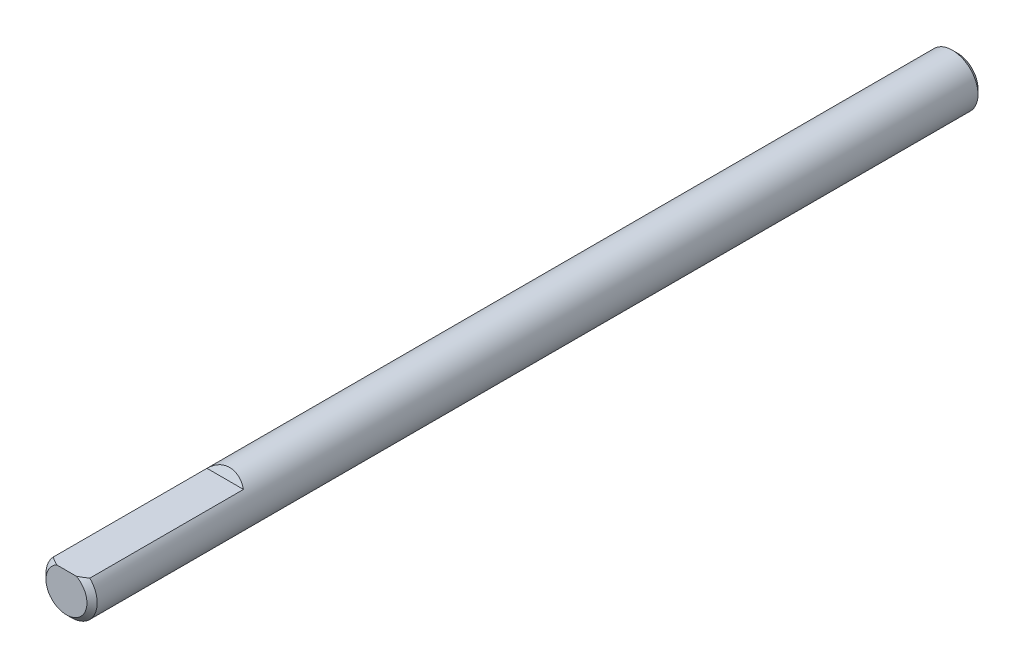
ISO-10303-21;
HEADER;
FILE_DESCRIPTION(('STEP AP214'),'2;1');
FILE_NAME('part.step','',(''),(''),'','','');
FILE_SCHEMA(('AUTOMOTIVE_DESIGN { 1 0 10303 214 1 1 1 1 }'));
ENDSEC;
DATA;
#1=APPLICATION_CONTEXT('core data for automotive mechanical design processes');
#2=APPLICATION_PROTOCOL_DEFINITION('international standard','automotive_design',2000,#1);
#3=PRODUCT_CONTEXT('',#1,'mechanical');
#4=PRODUCT('Part','Part','',(#3));
#5=PRODUCT_RELATED_PRODUCT_CATEGORY('part','',(#4));
#6=PRODUCT_DEFINITION_FORMATION('','',#4);
#7=PRODUCT_DEFINITION_CONTEXT('part definition',#1,'design');
#8=PRODUCT_DEFINITION('design','',#6,#7);
#9=PRODUCT_DEFINITION_SHAPE('','',#8);
#10=(LENGTH_UNIT() NAMED_UNIT(*) SI_UNIT(.MILLI.,.METRE.));
#11=(NAMED_UNIT(*) PLANE_ANGLE_UNIT() SI_UNIT($,.RADIAN.));
#12=(NAMED_UNIT(*) SI_UNIT($,.STERADIAN.) SOLID_ANGLE_UNIT());
#13=UNCERTAINTY_MEASURE_WITH_UNIT(LENGTH_MEASURE(1.E-05),#10,'distance_accuracy_value','');
#14=(GEOMETRIC_REPRESENTATION_CONTEXT(3) GLOBAL_UNCERTAINTY_ASSIGNED_CONTEXT((#13)) GLOBAL_UNIT_ASSIGNED_CONTEXT((#10,
#11,#12)) REPRESENTATION_CONTEXT('',''));
#15=CARTESIAN_POINT('',(0.,0.,0.));
#16=DIRECTION('',(0.,0.,1.));
#17=DIRECTION('',(1.,0.,0.));
#18=AXIS2_PLACEMENT_3D('',#15,#16,#17);
#19=CARTESIAN_POINT('',(0.,0.,87.));
#20=DIRECTION('',(0.,0.,-1.));
#21=DIRECTION('',(-1.,0.,0.));
#22=AXIS2_PLACEMENT_3D('',#19,#20,#21);
#23=CYLINDRICAL_SURFACE('',#22,2.5);
#24=CARTESIAN_POINT('',(0.,0.,0.500000000000014));
#25=DIRECTION('',(0.,0.,1.));
#26=DIRECTION('',(1.,0.,0.));
#27=AXIS2_PLACEMENT_3D('',#24,#25,#26);
#28=CIRCLE('',#27,2.5);
#29=CARTESIAN_POINT('',(2.5,0.,0.500000000000014));
#30=VERTEX_POINT('',#29);
#31=EDGE_CURVE('E112',#30,#30,#28,.T.);
#32=ORIENTED_EDGE('',*,*,#31,.T.);
#33=EDGE_LOOP('',(#32));
#34=FACE_BOUND('',#33,.T.);
#35=DIRECTION('',(0.,0.,-1.));
#36=VECTOR('',#35,1.);
#37=CARTESIAN_POINT('',(-1.78535710713571,1.75,87.));
#38=LINE('',#37,#36);
#39=CARTESIAN_POINT('',(-1.78535710713571,1.75,86.5));
#40=VERTEX_POINT('',#39);
#41=CARTESIAN_POINT('',(-1.78535710713571,1.75,71.5));
#42=VERTEX_POINT('',#41);
#43=EDGE_CURVE('E71',#40,#42,#38,.T.);
#44=ORIENTED_EDGE('',*,*,#43,.T.);
#45=CARTESIAN_POINT('',(0.,0.,72.5103629710818));
#46=DIRECTION('',(0.,-0.499999999999992,-0.866025403784443));
#47=DIRECTION('',(0.,0.866025403784443,-0.499999999999992));
#48=AXIS2_PLACEMENT_3D('',#45,#46,#47);
#49=ELLIPSE('',#48,2.88675134594811,2.5);
#50=CARTESIAN_POINT('',(1.78535710713571,1.75,71.5));
#51=VERTEX_POINT('',#50);
#52=EDGE_CURVE('E11',#42,#51,#49,.T.);
#53=ORIENTED_EDGE('',*,*,#52,.T.);
#54=DIRECTION('',(0.,0.,-1.));
#55=VECTOR('',#54,1.);
#56=CARTESIAN_POINT('',(1.78535710713571,1.75,87.));
#57=LINE('',#56,#55);
#58=CARTESIAN_POINT('',(1.78535710713571,1.75,86.5));
#59=VERTEX_POINT('',#58);
#60=EDGE_CURVE('E114',#51,#59,#57,.F.);
#61=ORIENTED_EDGE('',*,*,#60,.T.);
#62=CARTESIAN_POINT('',(0.,0.,86.5));
#63=DIRECTION('',(0.,0.,1.));
#64=DIRECTION('',(1.,0.,0.));
#65=AXIS2_PLACEMENT_3D('',#62,#63,#64);
#66=CIRCLE('',#65,2.5);
#67=EDGE_CURVE('E113',#59,#40,#66,.F.);
#68=ORIENTED_EDGE('',*,*,#67,.T.);
#69=EDGE_LOOP('',(#44,#53,#61,#68));
#70=FACE_BOUND('',#69,.T.);
#71=ADVANCED_FACE('F33',(#34,#70),#23,.T.);
#72=CARTESIAN_POINT('',(0.,0.,87.));
#73=DIRECTION('',(0.,0.,1.));
#74=DIRECTION('',(1.,0.,0.));
#75=AXIS2_PLACEMENT_3D('',#72,#73,#74);
#76=PLANE('',#75);
#77=DIRECTION('',(1.,0.,0.));
#78=VECTOR('',#77,1.);
#79=CARTESIAN_POINT('',(0.,1.75,87.));
#80=LINE('',#79,#78);
#81=CARTESIAN_POINT('',(-0.968245836551901,1.75,87.));
#82=VERTEX_POINT('',#81);
#83=CARTESIAN_POINT('',(0.968245836551901,1.75,87.));
#84=VERTEX_POINT('',#83);
#85=EDGE_CURVE('E70',#82,#84,#80,.T.);
#86=ORIENTED_EDGE('',*,*,#85,.F.);
#87=CARTESIAN_POINT('',(0.,0.,87.));
#88=DIRECTION('',(0.,0.,1.));
#89=DIRECTION('',(1.,0.,0.));
#90=AXIS2_PLACEMENT_3D('',#87,#88,#89);
#91=CIRCLE('',#90,2.00000000000002);
#92=EDGE_CURVE('E76',#82,#84,#91,.T.);
#93=ORIENTED_EDGE('',*,*,#92,.T.);
#94=EDGE_LOOP('',(#86,#93));
#95=FACE_BOUND('',#94,.T.);
#96=ADVANCED_FACE('F80',(#95),#76,.T.);
#97=CARTESIAN_POINT('',(0.,0.,0.));
#98=DIRECTION('',(0.,0.,1.));
#99=DIRECTION('',(1.,0.,0.));
#100=AXIS2_PLACEMENT_3D('',#97,#98,#99);
#101=PLANE('',#100);
#102=CARTESIAN_POINT('',(0.,0.,0.));
#103=DIRECTION('',(0.,0.,1.));
#104=DIRECTION('',(1.,0.,0.));
#105=AXIS2_PLACEMENT_3D('',#102,#103,#104);
#106=CIRCLE('',#105,1.99999999999998);
#107=CARTESIAN_POINT('',(1.99999999999998,0.,0.));
#108=VERTEX_POINT('',#107);
#109=EDGE_CURVE('E116',#108,#108,#106,.F.);
#110=ORIENTED_EDGE('',*,*,#109,.T.);
#111=EDGE_LOOP('',(#110));
#112=FACE_BOUND('',#111,.T.);
#113=ADVANCED_FACE('F100',(#112),#101,.F.);
#114=CARTESIAN_POINT('',(-2.5,1.75,71.));
#115=DIRECTION('',(0.,-1.,0.));
#116=DIRECTION('',(0.,0.,-1.));
#117=AXIS2_PLACEMENT_3D('',#114,#115,#116);
#118=PLANE('',#117);
#119=ORIENTED_EDGE('',*,*,#60,.F.);
#120=DIRECTION('',(-1.,0.,0.));
#121=VECTOR('',#120,1.);
#122=CARTESIAN_POINT('',(-2.5,1.75,71.5));
#123=LINE('',#122,#121);
#124=EDGE_CURVE('E41',#51,#42,#123,.T.);
#125=ORIENTED_EDGE('',*,*,#124,.T.);
#126=ORIENTED_EDGE('',*,*,#43,.F.);
#127=CARTESIAN_POINT('',(-1.78535710713571,1.75,86.5));
#128=CARTESIAN_POINT('',(-1.7202753002656,1.75,86.5464455529614));
#129=CARTESIAN_POINT('',(-1.65462093514881,1.75,86.5921184811459));
#130=CARTESIAN_POINT('',(-1.5220017438155,1.75,86.681262032774));
#131=CARTESIAN_POINT('',(-1.45503936645724,1.75,86.7247363099062));
#132=CARTESIAN_POINT('',(-1.31937664001586,1.75,86.8090142383526));
#133=CARTESIAN_POINT('',(-1.25067528543469,1.75,86.8498162932779));
#134=CARTESIAN_POINT('',(-1.11112672057166,1.75,86.9278491738168));
#135=CARTESIAN_POINT('',(-1.04027599650839,1.75,86.965073685335));
#136=CARTESIAN_POINT('',(-0.968245836551903,1.75,87.));
#137=B_SPLINE_CURVE_WITH_KNOTS('',3,(#127,#128,#129,#130,#131,#132,#133,#134,#135,#136),
.UNSPECIFIED.,.F.,.F.,(4,2,2,2,4),(0.,0.239883835668455,0.479354972256077,0.718967888272496,
0.958996222220333),.UNSPECIFIED.);
#138=EDGE_CURVE('E66',#40,#82,#137,.T.);
#139=ORIENTED_EDGE('',*,*,#138,.T.);
#140=ORIENTED_EDGE('',*,*,#85,.T.);
#141=CARTESIAN_POINT('',(0.968245836551901,1.75,87.));
#142=CARTESIAN_POINT('',(1.04027599650839,1.75,86.965073685335));
#143=CARTESIAN_POINT('',(1.11112672057165,1.75,86.9278491738168));
#144=CARTESIAN_POINT('',(1.25067528543469,1.75,86.8498162932779));
#145=CARTESIAN_POINT('',(1.31937664001586,1.75,86.8090142383526));
#146=CARTESIAN_POINT('',(1.45503936645724,1.75,86.7247363099062));
#147=CARTESIAN_POINT('',(1.5220017438155,1.75,86.681262032774));
#148=CARTESIAN_POINT('',(1.65462093514882,1.75,86.5921184811459));
#149=CARTESIAN_POINT('',(1.72027530026561,1.75,86.5464455529614));
#150=CARTESIAN_POINT('',(1.78535710713571,1.75,86.5));
#151=B_SPLINE_CURVE_WITH_KNOTS('',3,(#141,#142,#143,#144,#145,#146,#147,#148,#149,#150),
.UNSPECIFIED.,.F.,.F.,(4,2,2,2,4),(0.,0.240028333947838,0.479641249964258,0.719112386551885,
0.958996222220337),.UNSPECIFIED.);
#152=EDGE_CURVE('E75',#84,#59,#151,.T.);
#153=ORIENTED_EDGE('',*,*,#152,.T.);
#154=EDGE_LOOP('',(#119,#125,#126,#139,#140,#153));
#155=FACE_BOUND('',#154,.T.);
#156=ADVANCED_FACE('F68',(#155),#118,.F.);
#157=CARTESIAN_POINT('',(0.,0.,87.));
#158=DIRECTION('',(0.,0.,-1.));
#159=DIRECTION('',(-1.,0.,0.));
#160=AXIS2_PLACEMENT_3D('',#157,#158,#159);
#161=CONICAL_SURFACE('',#160,2.00000000000002,0.785398163397453);
#162=ORIENTED_EDGE('',*,*,#138,.F.);
#163=ORIENTED_EDGE('',*,*,#67,.F.);
#164=ORIENTED_EDGE('',*,*,#152,.F.);
#165=ORIENTED_EDGE('',*,*,#92,.F.);
#166=EDGE_LOOP('',(#162,#163,#164,#165));
#167=FACE_BOUND('',#166,.T.);
#168=ADVANCED_FACE('F82',(#167),#161,.T.);
#169=CARTESIAN_POINT('',(0.,0.,0.500000000000014));
#170=DIRECTION('',(0.,0.,1.));
#171=DIRECTION('',(1.,0.,0.));
#172=AXIS2_PLACEMENT_3D('',#169,#170,#171);
#173=CONICAL_SURFACE('',#172,2.5,0.785398163397453);
#174=ORIENTED_EDGE('',*,*,#109,.F.);
#175=EDGE_LOOP('',(#174));
#176=FACE_BOUND('',#175,.T.);
#177=ORIENTED_EDGE('',*,*,#31,.F.);
#178=EDGE_LOOP('',(#177));
#179=FACE_BOUND('',#178,.T.);
#180=ADVANCED_FACE('F121',(#176,#179),#173,.T.);
#181=CARTESIAN_POINT('',(0.,2.61602540378446,71.));
#182=DIRECTION('',(0.,-0.499999999999992,-0.866025403784443));
#183=DIRECTION('',(1.,0.,0.));
#184=AXIS2_PLACEMENT_3D('',#181,#182,#183);
#185=PLANE('',#184);
#186=ORIENTED_EDGE('',*,*,#52,.F.);
#187=ORIENTED_EDGE('',*,*,#124,.F.);
#188=EDGE_LOOP('',(#186,#187));
#189=FACE_BOUND('',#188,.T.);
#190=ADVANCED_FACE('F35',(#189),#185,.F.);
#191=CLOSED_SHELL('',(#71,#96,#113,#156,#168,#180,#190));
#192=MANIFOLD_SOLID_BREP('B2',#191);
#193=ADVANCED_BREP_SHAPE_REPRESENTATION('',(#18,#192),#14);
#194=SHAPE_DEFINITION_REPRESENTATION(#9,#193);
ENDSEC;
END-ISO-10303-21;
